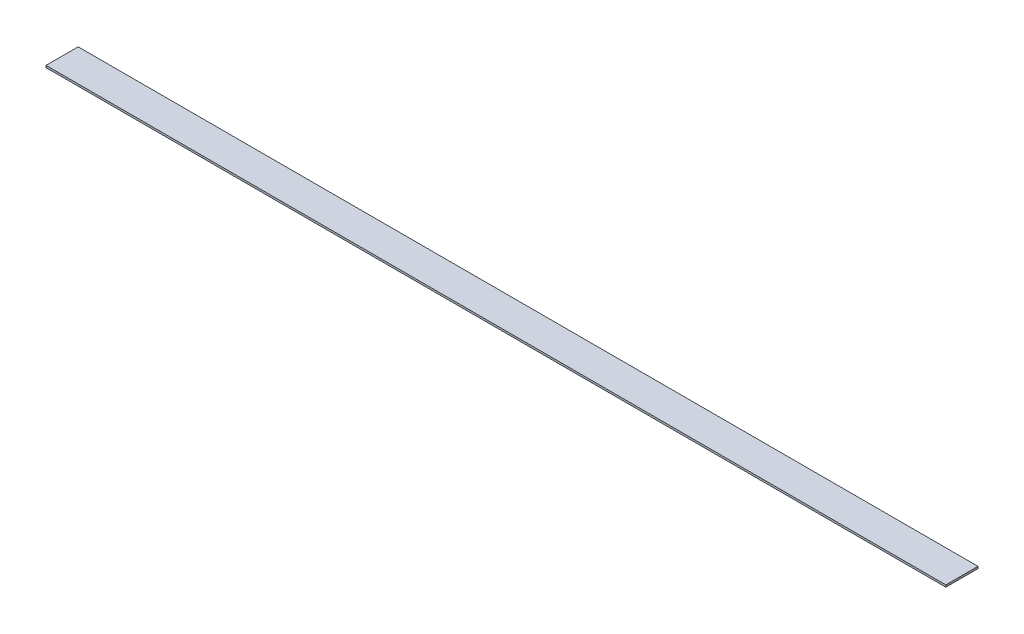
ISO-10303-21;
HEADER;
FILE_DESCRIPTION(('STEP AP214'),'2;1');
FILE_NAME('part.step','',(''),(''),'','','');
FILE_SCHEMA(('AUTOMOTIVE_DESIGN { 1 0 10303 214 1 1 1 1 }'));
ENDSEC;
DATA;
#1=APPLICATION_CONTEXT('core data for automotive mechanical design processes');
#2=APPLICATION_PROTOCOL_DEFINITION('international standard','automotive_design',2000,#1);
#3=PRODUCT_CONTEXT('',#1,'mechanical');
#4=PRODUCT('Part','Part','',(#3));
#5=PRODUCT_RELATED_PRODUCT_CATEGORY('part','',(#4));
#6=PRODUCT_DEFINITION_FORMATION('','',#4);
#7=PRODUCT_DEFINITION_CONTEXT('part definition',#1,'design');
#8=PRODUCT_DEFINITION('design','',#6,#7);
#9=PRODUCT_DEFINITION_SHAPE('','',#8);
#10=(LENGTH_UNIT() NAMED_UNIT(*) SI_UNIT(.MILLI.,.METRE.));
#11=(NAMED_UNIT(*) PLANE_ANGLE_UNIT() SI_UNIT($,.RADIAN.));
#12=(NAMED_UNIT(*) SI_UNIT($,.STERADIAN.) SOLID_ANGLE_UNIT());
#13=UNCERTAINTY_MEASURE_WITH_UNIT(LENGTH_MEASURE(1.E-05),#10,'distance_accuracy_value','');
#14=(GEOMETRIC_REPRESENTATION_CONTEXT(3) GLOBAL_UNCERTAINTY_ASSIGNED_CONTEXT((#13)) GLOBAL_UNIT_ASSIGNED_CONTEXT((#10,
#11,#12)) REPRESENTATION_CONTEXT('',''));
#15=CARTESIAN_POINT('',(0.,0.,0.));
#16=DIRECTION('',(0.,0.,1.));
#17=DIRECTION('',(1.,0.,0.));
#18=AXIS2_PLACEMENT_3D('',#15,#16,#17);
#19=CARTESIAN_POINT('',(0.,1.5875,0.));
#20=DIRECTION('',(1.,0.,0.));
#21=DIRECTION('',(0.,0.,-1.));
#22=AXIS2_PLACEMENT_3D('',#19,#20,#21);
#23=PLANE('',#22);
#24=DIRECTION('',(0.,0.,1.));
#25=VECTOR('',#24,1.);
#26=CARTESIAN_POINT('',(0.,0.,0.));
#27=LINE('',#26,#25);
#28=CARTESIAN_POINT('',(0.,0.,-25.4));
#29=VERTEX_POINT('',#28);
#30=CARTESIAN_POINT('',(0.,0.,0.));
#31=VERTEX_POINT('',#30);
#32=EDGE_CURVE('E96',#29,#31,#27,.T.);
#33=ORIENTED_EDGE('',*,*,#32,.T.);
#34=DIRECTION('',(0.,-1.,0.));
#35=VECTOR('',#34,1.);
#36=CARTESIAN_POINT('',(0.,1.5875,0.));
#37=LINE('',#36,#35);
#38=CARTESIAN_POINT('',(0.,1.5875,0.));
#39=VERTEX_POINT('',#38);
#40=EDGE_CURVE('E11',#39,#31,#37,.T.);
#41=ORIENTED_EDGE('',*,*,#40,.F.);
#42=DIRECTION('',(0.,0.,1.));
#43=VECTOR('',#42,1.);
#44=CARTESIAN_POINT('',(0.,1.5875,0.));
#45=LINE('',#44,#43);
#46=CARTESIAN_POINT('',(0.,1.5875,-25.4));
#47=VERTEX_POINT('',#46);
#48=EDGE_CURVE('E84',#47,#39,#45,.T.);
#49=ORIENTED_EDGE('',*,*,#48,.F.);
#50=DIRECTION('',(0.,-1.,0.));
#51=VECTOR('',#50,1.);
#52=CARTESIAN_POINT('',(0.,1.5875,-25.4));
#53=LINE('',#52,#51);
#54=EDGE_CURVE('E92',#47,#29,#53,.T.);
#55=ORIENTED_EDGE('',*,*,#54,.T.);
#56=EDGE_LOOP('',(#33,#41,#49,#55));
#57=FACE_BOUND('',#56,.T.);
#58=ADVANCED_FACE('F33',(#57),#23,.F.);
#59=CARTESIAN_POINT('',(0.,1.5875,0.));
#60=DIRECTION('',(0.,0.,-1.));
#61=DIRECTION('',(-1.,0.,0.));
#62=AXIS2_PLACEMENT_3D('',#59,#60,#61);
#63=PLANE('',#62);
#64=DIRECTION('',(1.,0.,0.));
#65=VECTOR('',#64,1.);
#66=CARTESIAN_POINT('',(0.,0.,0.));
#67=LINE('',#66,#65);
#68=CARTESIAN_POINT('',(711.2,0.,0.));
#69=VERTEX_POINT('',#68);
#70=EDGE_CURVE('E88',#31,#69,#67,.T.);
#71=ORIENTED_EDGE('',*,*,#70,.T.);
#72=DIRECTION('',(0.,-1.,0.));
#73=VECTOR('',#72,1.);
#74=CARTESIAN_POINT('',(711.2,1.5875,0.));
#75=LINE('',#74,#73);
#76=CARTESIAN_POINT('',(711.2,1.5875,0.));
#77=VERTEX_POINT('',#76);
#78=EDGE_CURVE('E41',#77,#69,#75,.T.);
#79=ORIENTED_EDGE('',*,*,#78,.F.);
#80=DIRECTION('',(1.,0.,0.));
#81=VECTOR('',#80,1.);
#82=CARTESIAN_POINT('',(0.,1.5875,0.));
#83=LINE('',#82,#81);
#84=EDGE_CURVE('E79',#39,#77,#83,.T.);
#85=ORIENTED_EDGE('',*,*,#84,.F.);
#86=ORIENTED_EDGE('',*,*,#40,.T.);
#87=EDGE_LOOP('',(#71,#79,#85,#86));
#88=FACE_BOUND('',#87,.T.);
#89=ADVANCED_FACE('F87',(#88),#63,.F.);
#90=CARTESIAN_POINT('',(711.2,1.5875,0.));
#91=DIRECTION('',(-1.,0.,0.));
#92=DIRECTION('',(0.,0.,1.));
#93=AXIS2_PLACEMENT_3D('',#90,#91,#92);
#94=PLANE('',#93);
#95=DIRECTION('',(0.,0.,-1.));
#96=VECTOR('',#95,1.);
#97=CARTESIAN_POINT('',(711.2,0.,0.));
#98=LINE('',#97,#96);
#99=CARTESIAN_POINT('',(711.2,0.,-25.4));
#100=VERTEX_POINT('',#99);
#101=EDGE_CURVE('E66',#69,#100,#98,.T.);
#102=ORIENTED_EDGE('',*,*,#101,.T.);
#103=DIRECTION('',(0.,-1.,0.));
#104=VECTOR('',#103,1.);
#105=CARTESIAN_POINT('',(711.2,1.5875,-25.4));
#106=LINE('',#105,#104);
#107=CARTESIAN_POINT('',(711.2,1.5875,-25.4));
#108=VERTEX_POINT('',#107);
#109=EDGE_CURVE('E89',#108,#100,#106,.T.);
#110=ORIENTED_EDGE('',*,*,#109,.F.);
#111=DIRECTION('',(0.,0.,-1.));
#112=VECTOR('',#111,1.);
#113=CARTESIAN_POINT('',(711.2,1.5875,0.));
#114=LINE('',#113,#112);
#115=EDGE_CURVE('E82',#77,#108,#114,.T.);
#116=ORIENTED_EDGE('',*,*,#115,.F.);
#117=ORIENTED_EDGE('',*,*,#78,.T.);
#118=EDGE_LOOP('',(#102,#110,#116,#117));
#119=FACE_BOUND('',#118,.T.);
#120=ADVANCED_FACE('F90',(#119),#94,.F.);
#121=CARTESIAN_POINT('',(0.,1.5875,-25.4));
#122=DIRECTION('',(0.,0.,1.));
#123=DIRECTION('',(1.,0.,0.));
#124=AXIS2_PLACEMENT_3D('',#121,#122,#123);
#125=PLANE('',#124);
#126=DIRECTION('',(-1.,0.,0.));
#127=VECTOR('',#126,1.);
#128=CARTESIAN_POINT('',(0.,0.,-25.4));
#129=LINE('',#128,#127);
#130=EDGE_CURVE('E72',#100,#29,#129,.T.);
#131=ORIENTED_EDGE('',*,*,#130,.T.);
#132=ORIENTED_EDGE('',*,*,#54,.F.);
#133=DIRECTION('',(-1.,0.,0.));
#134=VECTOR('',#133,1.);
#135=CARTESIAN_POINT('',(0.,1.5875,-25.4));
#136=LINE('',#135,#134);
#137=EDGE_CURVE('E49',#108,#47,#136,.T.);
#138=ORIENTED_EDGE('',*,*,#137,.F.);
#139=ORIENTED_EDGE('',*,*,#109,.T.);
#140=EDGE_LOOP('',(#131,#132,#138,#139));
#141=FACE_BOUND('',#140,.T.);
#142=ADVANCED_FACE('F103',(#141),#125,.F.);
#143=CARTESIAN_POINT('',(0.,1.5875,0.));
#144=DIRECTION('',(0.,-1.,0.));
#145=DIRECTION('',(0.,0.,-1.));
#146=AXIS2_PLACEMENT_3D('',#143,#144,#145);
#147=PLANE('',#146);
#148=ORIENTED_EDGE('',*,*,#48,.T.);
#149=ORIENTED_EDGE('',*,*,#84,.T.);
#150=ORIENTED_EDGE('',*,*,#115,.T.);
#151=ORIENTED_EDGE('',*,*,#137,.T.);
#152=EDGE_LOOP('',(#148,#149,#150,#151));
#153=FACE_BOUND('',#152,.T.);
#154=ADVANCED_FACE('F80',(#153),#147,.F.);
#155=CARTESIAN_POINT('',(0.,0.,0.));
#156=DIRECTION('',(0.,-1.,0.));
#157=DIRECTION('',(0.,0.,-1.));
#158=AXIS2_PLACEMENT_3D('',#155,#156,#157);
#159=PLANE('',#158);
#160=ORIENTED_EDGE('',*,*,#32,.F.);
#161=ORIENTED_EDGE('',*,*,#130,.F.);
#162=ORIENTED_EDGE('',*,*,#101,.F.);
#163=ORIENTED_EDGE('',*,*,#70,.F.);
#164=EDGE_LOOP('',(#160,#161,#162,#163));
#165=FACE_BOUND('',#164,.T.);
#166=ADVANCED_FACE('F106',(#165),#159,.T.);
#167=CLOSED_SHELL('',(#58,#89,#120,#142,#154,#166));
#168=MANIFOLD_SOLID_BREP('B2',#167);
#169=ADVANCED_BREP_SHAPE_REPRESENTATION('',(#18,#168),#14);
#170=SHAPE_DEFINITION_REPRESENTATION(#9,#169);
ENDSEC;
END-ISO-10303-21;
